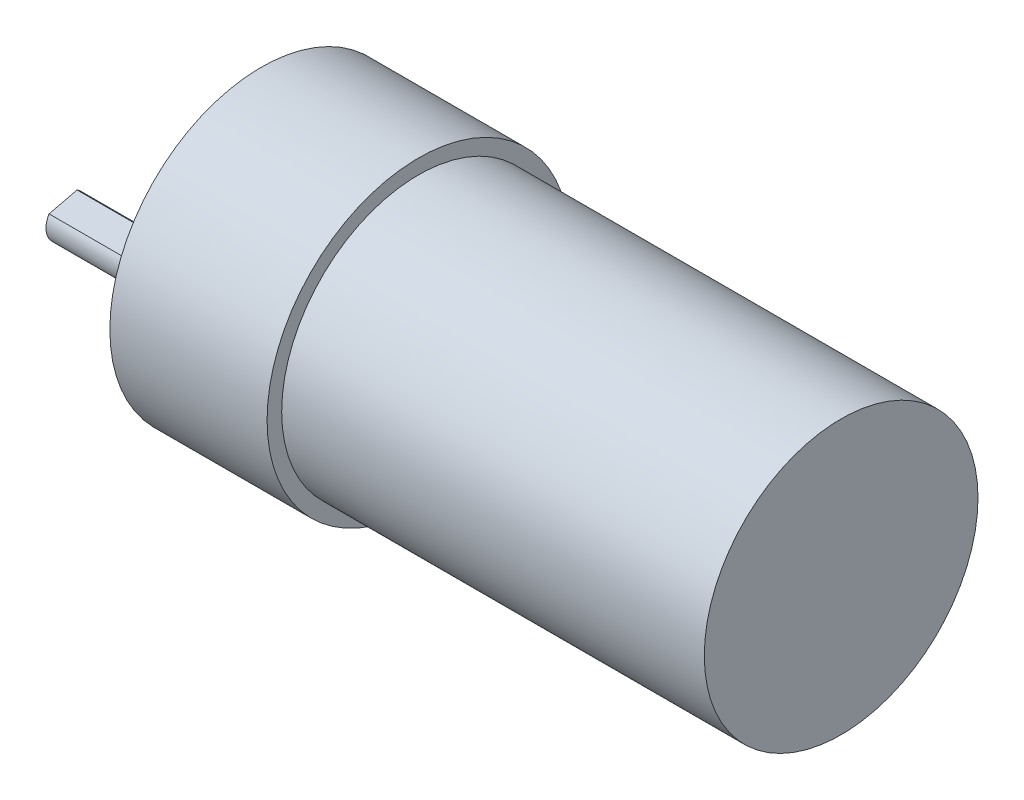
ISO-10303-21;
HEADER;
FILE_DESCRIPTION(('STEP AP214'),'2;1');
FILE_NAME('part.step','',(''),(''),'','','');
FILE_SCHEMA(('AUTOMOTIVE_DESIGN { 1 0 10303 214 1 1 1 1 }'));
ENDSEC;
DATA;
#1=APPLICATION_CONTEXT('core data for automotive mechanical design processes');
#2=APPLICATION_PROTOCOL_DEFINITION('international standard','automotive_design',2000,#1);
#3=PRODUCT_CONTEXT('',#1,'mechanical');
#4=PRODUCT('Part','Part','',(#3));
#5=PRODUCT_RELATED_PRODUCT_CATEGORY('part','',(#4));
#6=PRODUCT_DEFINITION_FORMATION('','',#4);
#7=PRODUCT_DEFINITION_CONTEXT('part definition',#1,'design');
#8=PRODUCT_DEFINITION('design','',#6,#7);
#9=PRODUCT_DEFINITION_SHAPE('','',#8);
#10=(LENGTH_UNIT() NAMED_UNIT(*) SI_UNIT(.MILLI.,.METRE.));
#11=(NAMED_UNIT(*) PLANE_ANGLE_UNIT() SI_UNIT($,.RADIAN.));
#12=(NAMED_UNIT(*) SI_UNIT($,.STERADIAN.) SOLID_ANGLE_UNIT());
#13=UNCERTAINTY_MEASURE_WITH_UNIT(LENGTH_MEASURE(1.E-05),#10,'distance_accuracy_value','');
#14=(GEOMETRIC_REPRESENTATION_CONTEXT(3) GLOBAL_UNCERTAINTY_ASSIGNED_CONTEXT((#13)) GLOBAL_UNIT_ASSIGNED_CONTEXT((#10,
#11,#12)) REPRESENTATION_CONTEXT('',''));
#15=CARTESIAN_POINT('',(0.,0.,0.));
#16=DIRECTION('',(0.,0.,1.));
#17=DIRECTION('',(1.,0.,0.));
#18=AXIS2_PLACEMENT_3D('',#15,#16,#17);
#19=CARTESIAN_POINT('',(-40.8432,-8.71855,0.));
#20=DIRECTION('',(1.,0.,0.));
#21=DIRECTION('',(0.,0.,-1.));
#22=AXIS2_PLACEMENT_3D('',#19,#20,#21);
#23=CYLINDRICAL_SURFACE('',#22,2.3749);
#24=CARTESIAN_POINT('',(-18.2372,-8.71855,0.));
#25=DIRECTION('',(-1.,0.,0.));
#26=DIRECTION('',(0.,0.,1.));
#27=AXIS2_PLACEMENT_3D('',#24,#25,#26);
#28=CIRCLE('',#27,2.3749);
#29=CARTESIAN_POINT('',(-18.2372,-8.71855,2.3749));
#30=VERTEX_POINT('',#29);
#31=EDGE_CURVE('E88',#30,#30,#28,.T.);
#32=ORIENTED_EDGE('',*,*,#31,.T.);
#33=EDGE_LOOP('',(#32));
#34=FACE_BOUND('',#33,.T.);
#35=DIRECTION('',(1.,0.,0.));
#36=VECTOR('',#35,1.);
#37=CARTESIAN_POINT('',(-40.8432,-6.68747817064265,-1.23081161596361));
#38=LINE('',#37,#36);
#39=CARTESIAN_POINT('',(-25.8572,-6.68747817064265,-1.23081161596361));
#40=VERTEX_POINT('',#39);
#41=CARTESIAN_POINT('',(-40.8432,-6.68747817064265,-1.23081161596361));
#42=VERTEX_POINT('',#41);
#43=EDGE_CURVE('E49',#40,#42,#38,.F.);
#44=ORIENTED_EDGE('',*,*,#43,.F.);
#45=CARTESIAN_POINT('',(-25.8572,-8.71855,0.));
#46=DIRECTION('',(1.,0.,0.));
#47=DIRECTION('',(0.,0.,-1.));
#48=AXIS2_PLACEMENT_3D('',#45,#46,#47);
#49=CIRCLE('',#48,2.3749);
#50=CARTESIAN_POINT('',(-25.8572,-7.46406700754952,2.01653723785416));
#51=VERTEX_POINT('',#50);
#52=EDGE_CURVE('E11',#40,#51,#49,.T.);
#53=ORIENTED_EDGE('',*,*,#52,.T.);
#54=DIRECTION('',(1.,0.,0.));
#55=VECTOR('',#54,1.);
#56=CARTESIAN_POINT('',(-40.8432,-7.46406700754952,2.01653723785416));
#57=LINE('',#56,#55);
#58=CARTESIAN_POINT('',(-40.8432,-7.46406700754952,2.01653723785416));
#59=VERTEX_POINT('',#58);
#60=EDGE_CURVE('E58',#59,#51,#57,.T.);
#61=ORIENTED_EDGE('',*,*,#60,.F.);
#62=CARTESIAN_POINT('',(-40.8432,-8.71855,0.));
#63=DIRECTION('',(-1.,0.,0.));
#64=DIRECTION('',(0.,0.,1.));
#65=AXIS2_PLACEMENT_3D('',#62,#63,#64);
#66=CIRCLE('',#65,2.3749);
#67=EDGE_CURVE('E70',#42,#59,#66,.T.);
#68=ORIENTED_EDGE('',*,*,#67,.F.);
#69=EDGE_LOOP('',(#44,#53,#61,#68));
#70=FACE_BOUND('',#69,.T.);
#71=ADVANCED_FACE('F34',(#34,#70),#23,.T.);
#72=CARTESIAN_POINT('',(-40.8432,-8.71855,0.));
#73=DIRECTION('',(-1.,0.,0.));
#74=DIRECTION('',(0.,0.,1.));
#75=AXIS2_PLACEMENT_3D('',#72,#73,#74);
#76=PLANE('',#75);
#77=ORIENTED_EDGE('',*,*,#67,.T.);
#78=DIRECTION('',(0.,0.232587064676617,-0.972575579245703));
#79=VECTOR('',#78,1.);
#80=CARTESIAN_POINT('',(-40.8432,-7.07577258909608,0.392862810945275));
#81=LINE('',#80,#79);
#82=EDGE_CURVE('E42',#59,#42,#81,.T.);
#83=ORIENTED_EDGE('',*,*,#82,.T.);
#84=EDGE_LOOP('',(#77,#83));
#85=FACE_BOUND('',#84,.T.);
#86=ADVANCED_FACE('F106',(#85),#76,.T.);
#87=CARTESIAN_POINT('',(-18.2372,0.,0.));
#88=DIRECTION('',(-1.,0.,0.));
#89=DIRECTION('',(0.,0.,1.));
#90=AXIS2_PLACEMENT_3D('',#87,#88,#89);
#91=PLANE('',#90);
#92=CARTESIAN_POINT('',(-18.2372,-8.71855,-10.2108));
#93=DIRECTION('',(-1.,0.,0.));
#94=DIRECTION('',(0.,0.,1.));
#95=AXIS2_PLACEMENT_3D('',#92,#93,#94);
#96=CIRCLE('',#95,1.27);
#97=CARTESIAN_POINT('',(-18.2372,-8.71855,-8.9408));
#98=VERTEX_POINT('',#97);
#99=EDGE_CURVE('E65',#98,#98,#96,.T.);
#100=ORIENTED_EDGE('',*,*,#99,.F.);
#101=EDGE_LOOP('',(#100));
#102=FACE_BOUND('',#101,.T.);
#103=CARTESIAN_POINT('',(-18.2372,-8.71855,10.2108));
#104=DIRECTION('',(-1.,0.,0.));
#105=DIRECTION('',(0.,0.,1.));
#106=AXIS2_PLACEMENT_3D('',#103,#104,#105);
#107=CIRCLE('',#106,1.27);
#108=CARTESIAN_POINT('',(-18.2372,-8.71855,11.4808));
#109=VERTEX_POINT('',#108);
#110=EDGE_CURVE('E76',#109,#109,#107,.T.);
#111=ORIENTED_EDGE('',*,*,#110,.F.);
#112=EDGE_LOOP('',(#111));
#113=FACE_BOUND('',#112,.T.);
#114=CARTESIAN_POINT('',(-18.2372,13.45565,0.));
#115=DIRECTION('',(-1.,0.,0.));
#116=DIRECTION('',(0.,0.,1.));
#117=AXIS2_PLACEMENT_3D('',#114,#115,#116);
#118=CIRCLE('',#117,1.27);
#119=CARTESIAN_POINT('',(-18.2372,13.45565,1.27));
#120=VERTEX_POINT('',#119);
#121=EDGE_CURVE('E82',#120,#120,#118,.T.);
#122=ORIENTED_EDGE('',*,*,#121,.F.);
#123=EDGE_LOOP('',(#122));
#124=FACE_BOUND('',#123,.T.);
#125=CARTESIAN_POINT('',(-18.2372,0.,0.));
#126=DIRECTION('',(-1.,0.,0.));
#127=DIRECTION('',(0.,0.,1.));
#128=AXIS2_PLACEMENT_3D('',#125,#126,#127);
#129=CIRCLE('',#128,17.56918);
#130=CARTESIAN_POINT('',(-18.2372,0.,17.56918));
#131=VERTEX_POINT('',#130);
#132=EDGE_CURVE('E95',#131,#131,#129,.T.);
#133=ORIENTED_EDGE('',*,*,#132,.T.);
#134=EDGE_LOOP('',(#133));
#135=FACE_BOUND('',#134,.T.);
#136=ORIENTED_EDGE('',*,*,#31,.F.);
#137=EDGE_LOOP('',(#136));
#138=FACE_BOUND('',#137,.T.);
#139=ADVANCED_FACE('F108',(#102,#113,#124,#135,#138),#91,.T.);
#140=CARTESIAN_POINT('',(49.022,0.,0.));
#141=DIRECTION('',(-1.,0.,0.));
#142=DIRECTION('',(0.,0.,1.));
#143=AXIS2_PLACEMENT_3D('',#140,#141,#142);
#144=CYLINDRICAL_SURFACE('',#143,15.875);
#145=CARTESIAN_POINT('',(49.022,0.,0.));
#146=DIRECTION('',(1.,0.,0.));
#147=DIRECTION('',(0.,0.,-1.));
#148=AXIS2_PLACEMENT_3D('',#145,#146,#147);
#149=CIRCLE('',#148,15.875);
#150=CARTESIAN_POINT('',(49.022,0.,-15.875));
#151=VERTEX_POINT('',#150);
#152=EDGE_CURVE('E103',#151,#151,#149,.T.);
#153=ORIENTED_EDGE('',*,*,#152,.F.);
#154=EDGE_LOOP('',(#153));
#155=FACE_BOUND('',#154,.T.);
#156=CARTESIAN_POINT('',(0.,0.,0.));
#157=DIRECTION('',(-1.,0.,0.));
#158=DIRECTION('',(0.,0.,1.));
#159=AXIS2_PLACEMENT_3D('',#156,#157,#158);
#160=CIRCLE('',#159,15.875);
#161=CARTESIAN_POINT('',(0.,0.,15.875));
#162=VERTEX_POINT('',#161);
#163=EDGE_CURVE('E98',#162,#162,#160,.T.);
#164=ORIENTED_EDGE('',*,*,#163,.F.);
#165=EDGE_LOOP('',(#164));
#166=FACE_BOUND('',#165,.T.);
#167=ADVANCED_FACE('F36',(#155,#166),#144,.T.);
#168=CARTESIAN_POINT('',(49.022,0.,0.));
#169=DIRECTION('',(1.,0.,0.));
#170=DIRECTION('',(0.,0.,-1.));
#171=AXIS2_PLACEMENT_3D('',#168,#169,#170);
#172=PLANE('',#171);
#173=ORIENTED_EDGE('',*,*,#152,.T.);
#174=EDGE_LOOP('',(#173));
#175=FACE_BOUND('',#174,.T.);
#176=ADVANCED_FACE('F126',(#175),#172,.T.);
#177=CARTESIAN_POINT('',(0.,0.,0.));
#178=DIRECTION('',(-1.,0.,0.));
#179=DIRECTION('',(0.,0.,1.));
#180=AXIS2_PLACEMENT_3D('',#177,#178,#179);
#181=PLANE('',#180);
#182=CARTESIAN_POINT('',(0.,0.,0.));
#183=DIRECTION('',(-1.,0.,0.));
#184=DIRECTION('',(0.,0.,1.));
#185=AXIS2_PLACEMENT_3D('',#182,#183,#184);
#186=CIRCLE('',#185,17.56918);
#187=CARTESIAN_POINT('',(0.,0.,17.56918));
#188=VERTEX_POINT('',#187);
#189=EDGE_CURVE('E92',#188,#188,#186,.T.);
#190=ORIENTED_EDGE('',*,*,#189,.F.);
#191=EDGE_LOOP('',(#190));
#192=FACE_BOUND('',#191,.T.);
#193=ORIENTED_EDGE('',*,*,#163,.T.);
#194=EDGE_LOOP('',(#193));
#195=FACE_BOUND('',#194,.T.);
#196=ADVANCED_FACE('F122',(#192,#195),#181,.F.);
#197=CARTESIAN_POINT('',(-18.2372,0.,0.));
#198=DIRECTION('',(1.,0.,0.));
#199=DIRECTION('',(0.,0.,-1.));
#200=AXIS2_PLACEMENT_3D('',#197,#198,#199);
#201=CYLINDRICAL_SURFACE('',#200,17.56918);
#202=ORIENTED_EDGE('',*,*,#132,.F.);
#203=EDGE_LOOP('',(#202));
#204=FACE_BOUND('',#203,.T.);
#205=ORIENTED_EDGE('',*,*,#189,.T.);
#206=EDGE_LOOP('',(#205));
#207=FACE_BOUND('',#206,.T.);
#208=ADVANCED_FACE('F125',(#204,#207),#201,.T.);
#209=CARTESIAN_POINT('',(-8.2372,13.45565,0.));
#210=DIRECTION('',(-1.,0.,0.));
#211=DIRECTION('',(0.,0.,1.));
#212=AXIS2_PLACEMENT_3D('',#209,#210,#211);
#213=CYLINDRICAL_SURFACE('',#212,1.27);
#214=CARTESIAN_POINT('',(-8.2372,13.45565,0.));
#215=DIRECTION('',(-1.,0.,0.));
#216=DIRECTION('',(0.,0.,1.));
#217=AXIS2_PLACEMENT_3D('',#214,#215,#216);
#218=CIRCLE('',#217,1.27);
#219=CARTESIAN_POINT('',(-8.2372,13.45565,1.27));
#220=VERTEX_POINT('',#219);
#221=EDGE_CURVE('E85',#220,#220,#218,.T.);
#222=ORIENTED_EDGE('',*,*,#221,.F.);
#223=EDGE_LOOP('',(#222));
#224=FACE_BOUND('',#223,.T.);
#225=ORIENTED_EDGE('',*,*,#121,.T.);
#226=EDGE_LOOP('',(#225));
#227=FACE_BOUND('',#226,.T.);
#228=ADVANCED_FACE('F119',(#224,#227),#213,.F.);
#229=CARTESIAN_POINT('',(-8.2372,13.45565,0.));
#230=DIRECTION('',(-1.,0.,0.));
#231=DIRECTION('',(0.,0.,1.));
#232=AXIS2_PLACEMENT_3D('',#229,#230,#231);
#233=PLANE('',#232);
#234=ORIENTED_EDGE('',*,*,#221,.T.);
#235=EDGE_LOOP('',(#234));
#236=FACE_BOUND('',#235,.T.);
#237=ADVANCED_FACE('F164',(#236),#233,.T.);
#238=CARTESIAN_POINT('',(-8.2372,-8.71855,10.2108));
#239=DIRECTION('',(-1.,0.,0.));
#240=DIRECTION('',(0.,0.,1.));
#241=AXIS2_PLACEMENT_3D('',#238,#239,#240);
#242=CYLINDRICAL_SURFACE('',#241,1.27);
#243=CARTESIAN_POINT('',(-8.2372,-8.71855,10.2108));
#244=DIRECTION('',(-1.,0.,0.));
#245=DIRECTION('',(0.,0.,1.));
#246=AXIS2_PLACEMENT_3D('',#243,#244,#245);
#247=CIRCLE('',#246,1.27);
#248=CARTESIAN_POINT('',(-8.2372,-8.71855,11.4808));
#249=VERTEX_POINT('',#248);
#250=EDGE_CURVE('E79',#249,#249,#247,.T.);
#251=ORIENTED_EDGE('',*,*,#250,.F.);
#252=EDGE_LOOP('',(#251));
#253=FACE_BOUND('',#252,.T.);
#254=ORIENTED_EDGE('',*,*,#110,.T.);
#255=EDGE_LOOP('',(#254));
#256=FACE_BOUND('',#255,.T.);
#257=ADVANCED_FACE('F170',(#253,#256),#242,.F.);
#258=CARTESIAN_POINT('',(-8.2372,-8.71855,10.2108));
#259=DIRECTION('',(-1.,0.,0.));
#260=DIRECTION('',(0.,0.,1.));
#261=AXIS2_PLACEMENT_3D('',#258,#259,#260);
#262=PLANE('',#261);
#263=ORIENTED_EDGE('',*,*,#250,.T.);
#264=EDGE_LOOP('',(#263));
#265=FACE_BOUND('',#264,.T.);
#266=ADVANCED_FACE('F176',(#265),#262,.T.);
#267=CARTESIAN_POINT('',(-8.2372,-8.71855,-10.2108));
#268=DIRECTION('',(-1.,0.,0.));
#269=DIRECTION('',(0.,0.,1.));
#270=AXIS2_PLACEMENT_3D('',#267,#268,#269);
#271=CYLINDRICAL_SURFACE('',#270,1.27);
#272=CARTESIAN_POINT('',(-8.2372,-8.71855,-10.2108));
#273=DIRECTION('',(-1.,0.,0.));
#274=DIRECTION('',(0.,0.,1.));
#275=AXIS2_PLACEMENT_3D('',#272,#273,#274);
#276=CIRCLE('',#275,1.27);
#277=CARTESIAN_POINT('',(-8.2372,-8.71855,-8.9408));
#278=VERTEX_POINT('',#277);
#279=EDGE_CURVE('E73',#278,#278,#276,.T.);
#280=ORIENTED_EDGE('',*,*,#279,.F.);
#281=EDGE_LOOP('',(#280));
#282=FACE_BOUND('',#281,.T.);
#283=ORIENTED_EDGE('',*,*,#99,.T.);
#284=EDGE_LOOP('',(#283));
#285=FACE_BOUND('',#284,.T.);
#286=ADVANCED_FACE('F184',(#282,#285),#271,.F.);
#287=CARTESIAN_POINT('',(-8.2372,-8.71855,-10.2108));
#288=DIRECTION('',(-1.,0.,0.));
#289=DIRECTION('',(0.,0.,1.));
#290=AXIS2_PLACEMENT_3D('',#287,#288,#289);
#291=PLANE('',#290);
#292=ORIENTED_EDGE('',*,*,#279,.T.);
#293=EDGE_LOOP('',(#292));
#294=FACE_BOUND('',#293,.T.);
#295=ADVANCED_FACE('F192',(#294),#291,.T.);
#296=CARTESIAN_POINT('',(-25.8572,-8.21958385216718,5.17577239912827));
#297=DIRECTION('',(1.,0.,0.));
#298=DIRECTION('',(0.,0.,-1.));
#299=AXIS2_PLACEMENT_3D('',#296,#297,#298);
#300=PLANE('',#299);
#301=DIRECTION('',(0.,0.232587064676617,-0.972575579245703));
#302=VECTOR('',#301,1.);
#303=CARTESIAN_POINT('',(-25.8572,-8.21958385216718,5.17577239912827));
#304=LINE('',#303,#302);
#305=EDGE_CURVE('E61',#51,#40,#304,.T.);
#306=ORIENTED_EDGE('',*,*,#305,.F.);
#307=ORIENTED_EDGE('',*,*,#52,.F.);
#308=EDGE_LOOP('',(#306,#307));
#309=FACE_BOUND('',#308,.T.);
#310=ADVANCED_FACE('F68',(#309),#300,.F.);
#311=CARTESIAN_POINT('',(-25.8572,-5.65789785603313,-5.5360582222337));
#312=DIRECTION('',(0.,0.972575579245703,0.232587064676617));
#313=DIRECTION('',(0.,-0.232587064676617,0.972575579245703));
#314=AXIS2_PLACEMENT_3D('',#311,#312,#313);
#315=PLANE('',#314);
#316=ORIENTED_EDGE('',*,*,#60,.T.);
#317=ORIENTED_EDGE('',*,*,#305,.T.);
#318=ORIENTED_EDGE('',*,*,#43,.T.);
#319=ORIENTED_EDGE('',*,*,#82,.F.);
#320=EDGE_LOOP('',(#316,#317,#318,#319));
#321=FACE_BOUND('',#320,.T.);
#322=ADVANCED_FACE('F60',(#321),#315,.T.);
#323=CLOSED_SHELL('',(#71,#86,#139,#167,#176,#196,#208,#228,#237,#257,#266,#286,#295,#310,#322));
#324=MANIFOLD_SOLID_BREP('B2',#323);
#325=ADVANCED_BREP_SHAPE_REPRESENTATION('',(#18,#324),#14);
#326=SHAPE_DEFINITION_REPRESENTATION(#9,#325);
ENDSEC;
END-ISO-10303-21;
